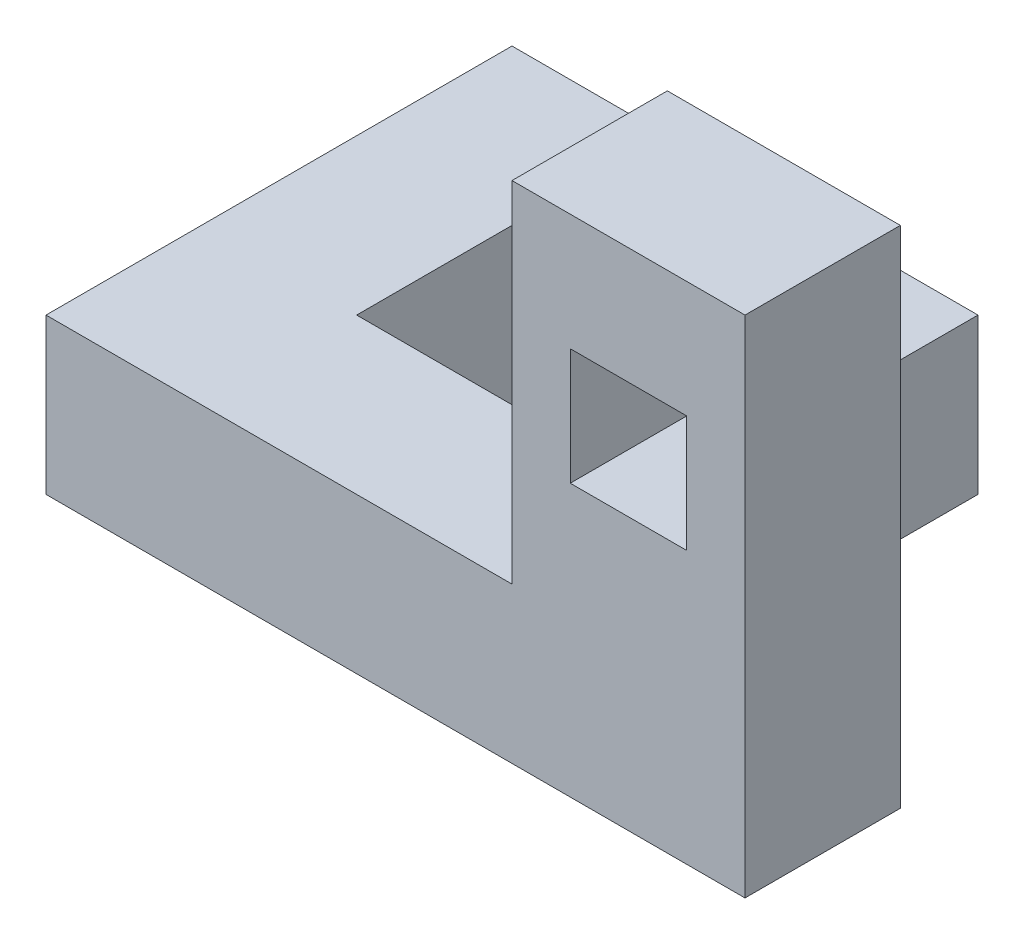
ISO-10303-21;
HEADER;
FILE_DESCRIPTION(('STEP AP214'),'2;1');
FILE_NAME('part.step','',(''),(''),'','','');
FILE_SCHEMA(('AUTOMOTIVE_DESIGN { 1 0 10303 214 1 1 1 1 }'));
ENDSEC;
DATA;
#1=APPLICATION_CONTEXT('core data for automotive mechanical design processes');
#2=APPLICATION_PROTOCOL_DEFINITION('international standard','automotive_design',2000,#1);
#3=PRODUCT_CONTEXT('',#1,'mechanical');
#4=PRODUCT('Part','Part','',(#3));
#5=PRODUCT_RELATED_PRODUCT_CATEGORY('part','',(#4));
#6=PRODUCT_DEFINITION_FORMATION('','',#4);
#7=PRODUCT_DEFINITION_CONTEXT('part definition',#1,'design');
#8=PRODUCT_DEFINITION('design','',#6,#7);
#9=PRODUCT_DEFINITION_SHAPE('','',#8);
#10=(LENGTH_UNIT() NAMED_UNIT(*) SI_UNIT(.MILLI.,.METRE.));
#11=(NAMED_UNIT(*) PLANE_ANGLE_UNIT() SI_UNIT($,.RADIAN.));
#12=(NAMED_UNIT(*) SI_UNIT($,.STERADIAN.) SOLID_ANGLE_UNIT());
#13=UNCERTAINTY_MEASURE_WITH_UNIT(LENGTH_MEASURE(1.E-05),#10,'distance_accuracy_value','');
#14=(GEOMETRIC_REPRESENTATION_CONTEXT(3) GLOBAL_UNCERTAINTY_ASSIGNED_CONTEXT((#13)) GLOBAL_UNIT_ASSIGNED_CONTEXT((#10,
#11,#12)) REPRESENTATION_CONTEXT('',''));
#15=CARTESIAN_POINT('',(0.,0.,0.));
#16=DIRECTION('',(0.,0.,1.));
#17=DIRECTION('',(1.,0.,0.));
#18=AXIS2_PLACEMENT_3D('',#15,#16,#17);
#19=CARTESIAN_POINT('',(0.,20.,0.));
#20=DIRECTION('',(0.,-1.,0.));
#21=DIRECTION('',(0.,0.,-1.));
#22=AXIS2_PLACEMENT_3D('',#19,#20,#21);
#23=PLANE('',#22);
#24=DIRECTION('',(0.,0.,-1.));
#25=VECTOR('',#24,1.);
#26=CARTESIAN_POINT('',(30.,20.,30.));
#27=LINE('',#26,#25);
#28=CARTESIAN_POINT('',(30.,20.,30.));
#29=VERTEX_POINT('',#28);
#30=CARTESIAN_POINT('',(30.,20.,9.99999999999999));
#31=VERTEX_POINT('',#30);
#32=EDGE_CURVE('E245',#29,#31,#27,.T.);
#33=ORIENTED_EDGE('',*,*,#32,.T.);
#34=CARTESIAN_POINT('',(30.,20.,-30.));
#35=VERTEX_POINT('',#34);
#36=EDGE_CURVE('E249',#31,#35,#27,.T.);
#37=ORIENTED_EDGE('',*,*,#36,.T.);
#38=DIRECTION('',(-1.,0.,0.));
#39=VECTOR('',#38,1.);
#40=CARTESIAN_POINT('',(-30.,20.,-30.));
#41=LINE('',#40,#39);
#42=CARTESIAN_POINT('',(-30.,20.,-30.));
#43=VERTEX_POINT('',#42);
#44=EDGE_CURVE('E248',#35,#43,#41,.T.);
#45=ORIENTED_EDGE('',*,*,#44,.T.);
#46=DIRECTION('',(0.,0.,1.));
#47=VECTOR('',#46,1.);
#48=CARTESIAN_POINT('',(-30.,20.,30.));
#49=LINE('',#48,#47);
#50=CARTESIAN_POINT('',(-30.,20.,30.));
#51=VERTEX_POINT('',#50);
#52=EDGE_CURVE('E251',#43,#51,#49,.T.);
#53=ORIENTED_EDGE('',*,*,#52,.T.);
#54=DIRECTION('',(1.,0.,0.));
#55=VECTOR('',#54,1.);
#56=CARTESIAN_POINT('',(-30.,20.,30.));
#57=LINE('',#56,#55);
#58=EDGE_CURVE('E253',#51,#29,#57,.T.);
#59=ORIENTED_EDGE('',*,*,#58,.T.);
#60=EDGE_LOOP('',(#33,#37,#45,#53,#59));
#61=FACE_BOUND('',#60,.T.);
#62=DIRECTION('',(0.,0.,-1.));
#63=VECTOR('',#62,1.);
#64=CARTESIAN_POINT('',(10.,20.,9.99999999999999));
#65=LINE('',#64,#63);
#66=CARTESIAN_POINT('',(10.,20.,9.99999999999999));
#67=VERTEX_POINT('',#66);
#68=CARTESIAN_POINT('',(10.,20.,-10.));
#69=VERTEX_POINT('',#68);
#70=EDGE_CURVE('E216',#67,#69,#65,.T.);
#71=ORIENTED_EDGE('',*,*,#70,.F.);
#72=DIRECTION('',(1.,0.,0.));
#73=VECTOR('',#72,1.);
#74=CARTESIAN_POINT('',(-9.99999999999999,20.,9.99999999999999));
#75=LINE('',#74,#73);
#76=CARTESIAN_POINT('',(-9.99999999999999,20.,9.99999999999999));
#77=VERTEX_POINT('',#76);
#78=EDGE_CURVE('E223',#77,#67,#75,.T.);
#79=ORIENTED_EDGE('',*,*,#78,.F.);
#80=DIRECTION('',(0.,0.,1.));
#81=VECTOR('',#80,1.);
#82=CARTESIAN_POINT('',(-9.99999999999999,20.,9.99999999999999));
#83=LINE('',#82,#81);
#84=CARTESIAN_POINT('',(-9.99999999999999,20.,-10.));
#85=VERTEX_POINT('',#84);
#86=EDGE_CURVE('E221',#85,#77,#83,.T.);
#87=ORIENTED_EDGE('',*,*,#86,.F.);
#88=DIRECTION('',(-1.,0.,0.));
#89=VECTOR('',#88,1.);
#90=CARTESIAN_POINT('',(-9.99999999999999,20.,-10.));
#91=LINE('',#90,#89);
#92=EDGE_CURVE('E218',#69,#85,#91,.T.);
#93=ORIENTED_EDGE('',*,*,#92,.F.);
#94=EDGE_LOOP('',(#71,#79,#87,#93));
#95=FACE_BOUND('',#94,.T.);
#96=ADVANCED_FACE('F37',(#61,#95),#23,.F.);
#97=CARTESIAN_POINT('',(0.,0.,0.));
#98=DIRECTION('',(0.,-1.,0.));
#99=DIRECTION('',(0.,0.,-1.));
#100=AXIS2_PLACEMENT_3D('',#97,#98,#99);
#101=PLANE('',#100);
#102=DIRECTION('',(0.,0.,-1.));
#103=VECTOR('',#102,1.);
#104=CARTESIAN_POINT('',(30.,0.,30.));
#105=LINE('',#104,#103);
#106=CARTESIAN_POINT('',(30.,0.,9.99999999999999));
#107=VERTEX_POINT('',#106);
#108=CARTESIAN_POINT('',(30.,0.,-30.));
#109=VERTEX_POINT('',#108);
#110=EDGE_CURVE('E244',#107,#109,#105,.T.);
#111=ORIENTED_EDGE('',*,*,#110,.F.);
#112=DIRECTION('',(1.,0.,0.));
#113=VECTOR('',#112,1.);
#114=CARTESIAN_POINT('',(30.,0.,9.99999999999999));
#115=LINE('',#114,#113);
#116=CARTESIAN_POINT('',(60.,0.,9.99999999999999));
#117=VERTEX_POINT('',#116);
#118=EDGE_CURVE('E54',#107,#117,#115,.T.);
#119=ORIENTED_EDGE('',*,*,#118,.T.);
#120=DIRECTION('',(0.,0.,1.));
#121=VECTOR('',#120,1.);
#122=CARTESIAN_POINT('',(60.,0.,9.99999999999999));
#123=LINE('',#122,#121);
#124=CARTESIAN_POINT('',(60.,0.,30.));
#125=VERTEX_POINT('',#124);
#126=EDGE_CURVE('E201',#117,#125,#123,.T.);
#127=ORIENTED_EDGE('',*,*,#126,.T.);
#128=DIRECTION('',(1.,0.,0.));
#129=VECTOR('',#128,1.);
#130=CARTESIAN_POINT('',(-30.,0.,30.));
#131=LINE('',#130,#129);
#132=CARTESIAN_POINT('',(-30.,0.,30.));
#133=VERTEX_POINT('',#132);
#134=EDGE_CURVE('E262',#133,#125,#131,.T.);
#135=ORIENTED_EDGE('',*,*,#134,.F.);
#136=DIRECTION('',(0.,0.,1.));
#137=VECTOR('',#136,1.);
#138=CARTESIAN_POINT('',(-30.,0.,30.));
#139=LINE('',#138,#137);
#140=CARTESIAN_POINT('',(-30.,0.,-30.));
#141=VERTEX_POINT('',#140);
#142=EDGE_CURVE('E260',#141,#133,#139,.T.);
#143=ORIENTED_EDGE('',*,*,#142,.F.);
#144=DIRECTION('',(-1.,0.,0.));
#145=VECTOR('',#144,1.);
#146=CARTESIAN_POINT('',(-30.,0.,-30.));
#147=LINE('',#146,#145);
#148=EDGE_CURVE('E258',#109,#141,#147,.T.);
#149=ORIENTED_EDGE('',*,*,#148,.F.);
#150=EDGE_LOOP('',(#111,#119,#127,#135,#143,#149));
#151=FACE_BOUND('',#150,.T.);
#152=DIRECTION('',(1.,0.,0.));
#153=VECTOR('',#152,1.);
#154=CARTESIAN_POINT('',(-9.99999999999999,0.,9.99999999999999));
#155=LINE('',#154,#153);
#156=CARTESIAN_POINT('',(-9.99999999999999,0.,9.99999999999999));
#157=VERTEX_POINT('',#156);
#158=CARTESIAN_POINT('',(10.,0.,9.99999999999999));
#159=VERTEX_POINT('',#158);
#160=EDGE_CURVE('E219',#157,#159,#155,.T.);
#161=ORIENTED_EDGE('',*,*,#160,.T.);
#162=DIRECTION('',(0.,0.,-1.));
#163=VECTOR('',#162,1.);
#164=CARTESIAN_POINT('',(10.,0.,9.99999999999999));
#165=LINE('',#164,#163);
#166=CARTESIAN_POINT('',(10.,0.,-10.));
#167=VERTEX_POINT('',#166);
#168=EDGE_CURVE('E211',#159,#167,#165,.T.);
#169=ORIENTED_EDGE('',*,*,#168,.T.);
#170=DIRECTION('',(-1.,0.,0.));
#171=VECTOR('',#170,1.);
#172=CARTESIAN_POINT('',(-9.99999999999999,0.,-10.));
#173=LINE('',#172,#171);
#174=CARTESIAN_POINT('',(-9.99999999999999,0.,-10.));
#175=VERTEX_POINT('',#174);
#176=EDGE_CURVE('E228',#167,#175,#173,.T.);
#177=ORIENTED_EDGE('',*,*,#176,.T.);
#178=DIRECTION('',(0.,0.,1.));
#179=VECTOR('',#178,1.);
#180=CARTESIAN_POINT('',(-9.99999999999999,0.,9.99999999999999));
#181=LINE('',#180,#179);
#182=EDGE_CURVE('E231',#175,#157,#181,.T.);
#183=ORIENTED_EDGE('',*,*,#182,.T.);
#184=EDGE_LOOP('',(#161,#169,#177,#183));
#185=FACE_BOUND('',#184,.T.);
#186=ADVANCED_FACE('F281',(#151,#185),#101,.T.);
#187=CARTESIAN_POINT('',(30.,20.,30.));
#188=DIRECTION('',(-1.,0.,0.));
#189=DIRECTION('',(0.,0.,1.));
#190=AXIS2_PLACEMENT_3D('',#187,#188,#189);
#191=PLANE('',#190);
#192=ORIENTED_EDGE('',*,*,#36,.F.);
#193=DIRECTION('',(0.,-1.,0.));
#194=VECTOR('',#193,1.);
#195=CARTESIAN_POINT('',(30.,0.,9.99999999999999));
#196=LINE('',#195,#194);
#197=EDGE_CURVE('E11',#31,#107,#196,.T.);
#198=ORIENTED_EDGE('',*,*,#197,.T.);
#199=ORIENTED_EDGE('',*,*,#110,.T.);
#200=DIRECTION('',(0.,-1.,0.));
#201=VECTOR('',#200,1.);
#202=CARTESIAN_POINT('',(30.,20.,-30.));
#203=LINE('',#202,#201);
#204=EDGE_CURVE('E41',#35,#109,#203,.T.);
#205=ORIENTED_EDGE('',*,*,#204,.F.);
#206=EDGE_LOOP('',(#192,#198,#199,#205));
#207=FACE_BOUND('',#206,.T.);
#208=ADVANCED_FACE('F39',(#207),#191,.F.);
#209=CARTESIAN_POINT('',(-30.,20.,-30.));
#210=DIRECTION('',(0.,0.,1.));
#211=DIRECTION('',(1.,0.,0.));
#212=AXIS2_PLACEMENT_3D('',#209,#210,#211);
#213=PLANE('',#212);
#214=ORIENTED_EDGE('',*,*,#148,.T.);
#215=DIRECTION('',(0.,-1.,0.));
#216=VECTOR('',#215,1.);
#217=CARTESIAN_POINT('',(-30.,20.,-30.));
#218=LINE('',#217,#216);
#219=EDGE_CURVE('E265',#43,#141,#218,.T.);
#220=ORIENTED_EDGE('',*,*,#219,.F.);
#221=ORIENTED_EDGE('',*,*,#44,.F.);
#222=ORIENTED_EDGE('',*,*,#204,.T.);
#223=EDGE_LOOP('',(#214,#220,#221,#222));
#224=FACE_BOUND('',#223,.T.);
#225=ADVANCED_FACE('F275',(#224),#213,.F.);
#226=CARTESIAN_POINT('',(-30.,20.,30.));
#227=DIRECTION('',(1.,0.,0.));
#228=DIRECTION('',(0.,0.,-1.));
#229=AXIS2_PLACEMENT_3D('',#226,#227,#228);
#230=PLANE('',#229);
#231=ORIENTED_EDGE('',*,*,#142,.T.);
#232=DIRECTION('',(0.,-1.,0.));
#233=VECTOR('',#232,1.);
#234=CARTESIAN_POINT('',(-30.,20.,30.));
#235=LINE('',#234,#233);
#236=EDGE_CURVE('E256',#51,#133,#235,.T.);
#237=ORIENTED_EDGE('',*,*,#236,.F.);
#238=ORIENTED_EDGE('',*,*,#52,.F.);
#239=ORIENTED_EDGE('',*,*,#219,.T.);
#240=EDGE_LOOP('',(#231,#237,#238,#239));
#241=FACE_BOUND('',#240,.T.);
#242=ADVANCED_FACE('F285',(#241),#230,.F.);
#243=CARTESIAN_POINT('',(-30.,20.,30.));
#244=DIRECTION('',(0.,0.,-1.));
#245=DIRECTION('',(-1.,0.,0.));
#246=AXIS2_PLACEMENT_3D('',#243,#244,#245);
#247=PLANE('',#246);
#248=ORIENTED_EDGE('',*,*,#134,.T.);
#249=DIRECTION('',(0.,1.,0.));
#250=VECTOR('',#249,1.);
#251=CARTESIAN_POINT('',(60.,0.,30.));
#252=LINE('',#251,#250);
#253=CARTESIAN_POINT('',(60.,65.,30.));
#254=VERTEX_POINT('',#253);
#255=EDGE_CURVE('E204',#125,#254,#252,.T.);
#256=ORIENTED_EDGE('',*,*,#255,.T.);
#257=DIRECTION('',(-1.,0.,0.));
#258=VECTOR('',#257,1.);
#259=CARTESIAN_POINT('',(30.,65.,30.));
#260=LINE('',#259,#258);
#261=CARTESIAN_POINT('',(30.,65.,30.));
#262=VERTEX_POINT('',#261);
#263=EDGE_CURVE('E193',#254,#262,#260,.T.);
#264=ORIENTED_EDGE('',*,*,#263,.T.);
#265=DIRECTION('',(0.,-1.,0.));
#266=VECTOR('',#265,1.);
#267=CARTESIAN_POINT('',(30.,0.,30.));
#268=LINE('',#267,#266);
#269=EDGE_CURVE('E188',#262,#29,#268,.T.);
#270=ORIENTED_EDGE('',*,*,#269,.T.);
#271=ORIENTED_EDGE('',*,*,#58,.F.);
#272=ORIENTED_EDGE('',*,*,#236,.T.);
#273=EDGE_LOOP('',(#248,#256,#264,#270,#271,#272));
#274=FACE_BOUND('',#273,.T.);
#275=DIRECTION('',(-1.,0.,0.));
#276=VECTOR('',#275,1.);
#277=CARTESIAN_POINT('',(37.5,50.,30.));
#278=LINE('',#277,#276);
#279=CARTESIAN_POINT('',(52.5,50.,30.));
#280=VERTEX_POINT('',#279);
#281=CARTESIAN_POINT('',(37.5,50.,30.));
#282=VERTEX_POINT('',#281);
#283=EDGE_CURVE('E182',#280,#282,#278,.T.);
#284=ORIENTED_EDGE('',*,*,#283,.F.);
#285=DIRECTION('',(0.,1.,0.));
#286=VECTOR('',#285,1.);
#287=CARTESIAN_POINT('',(52.5,35.,30.));
#288=LINE('',#287,#286);
#289=CARTESIAN_POINT('',(52.5,35.,30.));
#290=VERTEX_POINT('',#289);
#291=EDGE_CURVE('E156',#290,#280,#288,.T.);
#292=ORIENTED_EDGE('',*,*,#291,.F.);
#293=DIRECTION('',(1.,0.,0.));
#294=VECTOR('',#293,1.);
#295=CARTESIAN_POINT('',(37.5,35.,30.));
#296=LINE('',#295,#294);
#297=CARTESIAN_POINT('',(37.5,35.,30.));
#298=VERTEX_POINT('',#297);
#299=EDGE_CURVE('E173',#298,#290,#296,.T.);
#300=ORIENTED_EDGE('',*,*,#299,.F.);
#301=DIRECTION('',(0.,-1.,0.));
#302=VECTOR('',#301,1.);
#303=CARTESIAN_POINT('',(37.5,35.,30.));
#304=LINE('',#303,#302);
#305=EDGE_CURVE('E176',#282,#298,#304,.T.);
#306=ORIENTED_EDGE('',*,*,#305,.F.);
#307=EDGE_LOOP('',(#284,#292,#300,#306));
#308=FACE_BOUND('',#307,.T.);
#309=ADVANCED_FACE('F288',(#274,#308),#247,.F.);
#310=CARTESIAN_POINT('',(10.,20.,9.99999999999999));
#311=DIRECTION('',(-1.,0.,0.));
#312=DIRECTION('',(0.,0.,1.));
#313=AXIS2_PLACEMENT_3D('',#310,#311,#312);
#314=PLANE('',#313);
#315=ORIENTED_EDGE('',*,*,#168,.F.);
#316=DIRECTION('',(0.,-1.,0.));
#317=VECTOR('',#316,1.);
#318=CARTESIAN_POINT('',(10.,20.,9.99999999999999));
#319=LINE('',#318,#317);
#320=EDGE_CURVE('E225',#67,#159,#319,.T.);
#321=ORIENTED_EDGE('',*,*,#320,.F.);
#322=ORIENTED_EDGE('',*,*,#70,.T.);
#323=DIRECTION('',(0.,-1.,0.));
#324=VECTOR('',#323,1.);
#325=CARTESIAN_POINT('',(10.,20.,-10.));
#326=LINE('',#325,#324);
#327=EDGE_CURVE('E241',#69,#167,#326,.T.);
#328=ORIENTED_EDGE('',*,*,#327,.T.);
#329=EDGE_LOOP('',(#315,#321,#322,#328));
#330=FACE_BOUND('',#329,.T.);
#331=ADVANCED_FACE('F321',(#330),#314,.T.);
#332=CARTESIAN_POINT('',(-9.99999999999999,20.,-10.));
#333=DIRECTION('',(0.,0.,1.));
#334=DIRECTION('',(1.,0.,0.));
#335=AXIS2_PLACEMENT_3D('',#332,#333,#334);
#336=PLANE('',#335);
#337=ORIENTED_EDGE('',*,*,#176,.F.);
#338=ORIENTED_EDGE('',*,*,#327,.F.);
#339=ORIENTED_EDGE('',*,*,#92,.T.);
#340=DIRECTION('',(0.,-1.,0.));
#341=VECTOR('',#340,1.);
#342=CARTESIAN_POINT('',(-9.99999999999999,20.,-10.));
#343=LINE('',#342,#341);
#344=EDGE_CURVE('E239',#85,#175,#343,.T.);
#345=ORIENTED_EDGE('',*,*,#344,.T.);
#346=EDGE_LOOP('',(#337,#338,#339,#345));
#347=FACE_BOUND('',#346,.T.);
#348=ADVANCED_FACE('F411',(#347),#336,.T.);
#349=CARTESIAN_POINT('',(-9.99999999999999,20.,9.99999999999999));
#350=DIRECTION('',(1.,0.,0.));
#351=DIRECTION('',(0.,0.,-1.));
#352=AXIS2_PLACEMENT_3D('',#349,#350,#351);
#353=PLANE('',#352);
#354=ORIENTED_EDGE('',*,*,#182,.F.);
#355=ORIENTED_EDGE('',*,*,#344,.F.);
#356=ORIENTED_EDGE('',*,*,#86,.T.);
#357=DIRECTION('',(0.,-1.,0.));
#358=VECTOR('',#357,1.);
#359=CARTESIAN_POINT('',(-9.99999999999999,20.,9.99999999999999));
#360=LINE('',#359,#358);
#361=EDGE_CURVE('E61',#77,#157,#360,.T.);
#362=ORIENTED_EDGE('',*,*,#361,.T.);
#363=EDGE_LOOP('',(#354,#355,#356,#362));
#364=FACE_BOUND('',#363,.T.);
#365=ADVANCED_FACE('F407',(#364),#353,.T.);
#366=CARTESIAN_POINT('',(-9.99999999999999,20.,9.99999999999999));
#367=DIRECTION('',(0.,0.,-1.));
#368=DIRECTION('',(-1.,0.,0.));
#369=AXIS2_PLACEMENT_3D('',#366,#367,#368);
#370=PLANE('',#369);
#371=ORIENTED_EDGE('',*,*,#160,.F.);
#372=ORIENTED_EDGE('',*,*,#361,.F.);
#373=ORIENTED_EDGE('',*,*,#78,.T.);
#374=ORIENTED_EDGE('',*,*,#320,.T.);
#375=EDGE_LOOP('',(#371,#372,#373,#374));
#376=FACE_BOUND('',#375,.T.);
#377=ADVANCED_FACE('F349',(#376),#370,.T.);
#378=CARTESIAN_POINT('',(30.,0.,9.99999999999999));
#379=DIRECTION('',(-1.,0.,0.));
#380=DIRECTION('',(0.,-1.,0.));
#381=AXIS2_PLACEMENT_3D('',#378,#379,#380);
#382=PLANE('',#381);
#383=ORIENTED_EDGE('',*,*,#32,.F.);
#384=ORIENTED_EDGE('',*,*,#269,.F.);
#385=DIRECTION('',(0.,0.,1.));
#386=VECTOR('',#385,1.);
#387=CARTESIAN_POINT('',(30.,65.,9.99999999999999));
#388=LINE('',#387,#386);
#389=CARTESIAN_POINT('',(30.,65.,9.99999999999999));
#390=VERTEX_POINT('',#389);
#391=EDGE_CURVE('E209',#390,#262,#388,.T.);
#392=ORIENTED_EDGE('',*,*,#391,.F.);
#393=EDGE_CURVE('E47',#390,#31,#196,.T.);
#394=ORIENTED_EDGE('',*,*,#393,.T.);
#395=EDGE_LOOP('',(#383,#384,#392,#394));
#396=FACE_BOUND('',#395,.T.);
#397=ADVANCED_FACE('F294',(#396),#382,.T.);
#398=CARTESIAN_POINT('',(30.,65.,9.99999999999999));
#399=DIRECTION('',(0.,1.,0.));
#400=DIRECTION('',(0.,0.,1.));
#401=AXIS2_PLACEMENT_3D('',#398,#399,#400);
#402=PLANE('',#401);
#403=ORIENTED_EDGE('',*,*,#263,.F.);
#404=DIRECTION('',(0.,0.,1.));
#405=VECTOR('',#404,1.);
#406=CARTESIAN_POINT('',(60.,65.,9.99999999999999));
#407=LINE('',#406,#405);
#408=CARTESIAN_POINT('',(60.,65.,9.99999999999999));
#409=VERTEX_POINT('',#408);
#410=EDGE_CURVE('E212',#409,#254,#407,.T.);
#411=ORIENTED_EDGE('',*,*,#410,.F.);
#412=DIRECTION('',(-1.,0.,0.));
#413=VECTOR('',#412,1.);
#414=CARTESIAN_POINT('',(30.,65.,9.99999999999999));
#415=LINE('',#414,#413);
#416=EDGE_CURVE('E198',#409,#390,#415,.T.);
#417=ORIENTED_EDGE('',*,*,#416,.T.);
#418=ORIENTED_EDGE('',*,*,#391,.T.);
#419=EDGE_LOOP('',(#403,#411,#417,#418));
#420=FACE_BOUND('',#419,.T.);
#421=ADVANCED_FACE('F299',(#420),#402,.T.);
#422=CARTESIAN_POINT('',(60.,0.,9.99999999999999));
#423=DIRECTION('',(1.,0.,0.));
#424=DIRECTION('',(0.,0.,-1.));
#425=AXIS2_PLACEMENT_3D('',#422,#423,#424);
#426=PLANE('',#425);
#427=ORIENTED_EDGE('',*,*,#255,.F.);
#428=ORIENTED_EDGE('',*,*,#126,.F.);
#429=DIRECTION('',(0.,1.,0.));
#430=VECTOR('',#429,1.);
#431=CARTESIAN_POINT('',(60.,0.,9.99999999999999));
#432=LINE('',#431,#430);
#433=EDGE_CURVE('E195',#117,#409,#432,.T.);
#434=ORIENTED_EDGE('',*,*,#433,.T.);
#435=ORIENTED_EDGE('',*,*,#410,.T.);
#436=EDGE_LOOP('',(#427,#428,#434,#435));
#437=FACE_BOUND('',#436,.T.);
#438=ADVANCED_FACE('F302',(#437),#426,.T.);
#439=CARTESIAN_POINT('',(0.,0.,9.99999999999999));
#440=DIRECTION('',(0.,0.,-1.));
#441=DIRECTION('',(-1.,0.,0.));
#442=AXIS2_PLACEMENT_3D('',#439,#440,#441);
#443=PLANE('',#442);
#444=DIRECTION('',(0.,1.,0.));
#445=VECTOR('',#444,1.);
#446=CARTESIAN_POINT('',(52.5,35.,9.99999999999999));
#447=LINE('',#446,#445);
#448=CARTESIAN_POINT('',(52.5,35.,9.99999999999999));
#449=VERTEX_POINT('',#448);
#450=CARTESIAN_POINT('',(52.5,50.,9.99999999999999));
#451=VERTEX_POINT('',#450);
#452=EDGE_CURVE('E153',#449,#451,#447,.T.);
#453=ORIENTED_EDGE('',*,*,#452,.T.);
#454=DIRECTION('',(-1.,0.,0.));
#455=VECTOR('',#454,1.);
#456=CARTESIAN_POINT('',(37.5,50.,9.99999999999999));
#457=LINE('',#456,#455);
#458=CARTESIAN_POINT('',(37.5,50.,9.99999999999999));
#459=VERTEX_POINT('',#458);
#460=EDGE_CURVE('E165',#451,#459,#457,.T.);
#461=ORIENTED_EDGE('',*,*,#460,.T.);
#462=DIRECTION('',(0.,-1.,0.));
#463=VECTOR('',#462,1.);
#464=CARTESIAN_POINT('',(37.5,35.,9.99999999999999));
#465=LINE('',#464,#463);
#466=CARTESIAN_POINT('',(37.5,35.,9.99999999999999));
#467=VERTEX_POINT('',#466);
#468=EDGE_CURVE('E169',#459,#467,#465,.T.);
#469=ORIENTED_EDGE('',*,*,#468,.T.);
#470=DIRECTION('',(1.,0.,0.));
#471=VECTOR('',#470,1.);
#472=CARTESIAN_POINT('',(37.5,35.,9.99999999999999));
#473=LINE('',#472,#471);
#474=EDGE_CURVE('E161',#467,#449,#473,.T.);
#475=ORIENTED_EDGE('',*,*,#474,.T.);
#476=EDGE_LOOP('',(#453,#461,#469,#475));
#477=FACE_BOUND('',#476,.T.);
#478=ORIENTED_EDGE('',*,*,#393,.F.);
#479=ORIENTED_EDGE('',*,*,#416,.F.);
#480=ORIENTED_EDGE('',*,*,#433,.F.);
#481=ORIENTED_EDGE('',*,*,#118,.F.);
#482=ORIENTED_EDGE('',*,*,#197,.F.);
#483=EDGE_LOOP('',(#478,#479,#480,#481,#482));
#484=FACE_BOUND('',#483,.T.);
#485=ADVANCED_FACE('F171',(#477,#484),#443,.T.);
#486=CARTESIAN_POINT('',(52.5,35.,9.99999999999999));
#487=DIRECTION('',(1.,0.,0.));
#488=DIRECTION('',(0.,0.,-1.));
#489=AXIS2_PLACEMENT_3D('',#486,#487,#488);
#490=PLANE('',#489);
#491=ORIENTED_EDGE('',*,*,#291,.T.);
#492=DIRECTION('',(0.,0.,1.));
#493=VECTOR('',#492,1.);
#494=CARTESIAN_POINT('',(52.5,50.,9.99999999999999));
#495=LINE('',#494,#493);
#496=EDGE_CURVE('E149',#451,#280,#495,.T.);
#497=ORIENTED_EDGE('',*,*,#496,.F.);
#498=ORIENTED_EDGE('',*,*,#452,.F.);
#499=DIRECTION('',(0.,0.,1.));
#500=VECTOR('',#499,1.);
#501=CARTESIAN_POINT('',(52.5,35.,9.99999999999999));
#502=LINE('',#501,#500);
#503=EDGE_CURVE('E186',#449,#290,#502,.T.);
#504=ORIENTED_EDGE('',*,*,#503,.T.);
#505=EDGE_LOOP('',(#491,#497,#498,#504));
#506=FACE_BOUND('',#505,.T.);
#507=ADVANCED_FACE('F151',(#506),#490,.F.);
#508=CARTESIAN_POINT('',(37.5,35.,9.99999999999999));
#509=DIRECTION('',(0.,-1.,0.));
#510=DIRECTION('',(0.,0.,-1.));
#511=AXIS2_PLACEMENT_3D('',#508,#509,#510);
#512=PLANE('',#511);
#513=ORIENTED_EDGE('',*,*,#299,.T.);
#514=ORIENTED_EDGE('',*,*,#503,.F.);
#515=ORIENTED_EDGE('',*,*,#474,.F.);
#516=DIRECTION('',(0.,0.,1.));
#517=VECTOR('',#516,1.);
#518=CARTESIAN_POINT('',(37.5,35.,9.99999999999999));
#519=LINE('',#518,#517);
#520=EDGE_CURVE('E189',#467,#298,#519,.T.);
#521=ORIENTED_EDGE('',*,*,#520,.T.);
#522=EDGE_LOOP('',(#513,#514,#515,#521));
#523=FACE_BOUND('',#522,.T.);
#524=ADVANCED_FACE('F373',(#523),#512,.F.);
#525=CARTESIAN_POINT('',(37.5,35.,9.99999999999999));
#526=DIRECTION('',(-1.,0.,0.));
#527=DIRECTION('',(0.,0.,1.));
#528=AXIS2_PLACEMENT_3D('',#525,#526,#527);
#529=PLANE('',#528);
#530=ORIENTED_EDGE('',*,*,#305,.T.);
#531=ORIENTED_EDGE('',*,*,#520,.F.);
#532=ORIENTED_EDGE('',*,*,#468,.F.);
#533=DIRECTION('',(0.,0.,1.));
#534=VECTOR('',#533,1.);
#535=CARTESIAN_POINT('',(37.5,50.,9.99999999999999));
#536=LINE('',#535,#534);
#537=EDGE_CURVE('E160',#459,#282,#536,.T.);
#538=ORIENTED_EDGE('',*,*,#537,.T.);
#539=EDGE_LOOP('',(#530,#531,#532,#538));
#540=FACE_BOUND('',#539,.T.);
#541=ADVANCED_FACE('F382',(#540),#529,.F.);
#542=CARTESIAN_POINT('',(37.5,50.,9.99999999999999));
#543=DIRECTION('',(0.,1.,0.));
#544=DIRECTION('',(0.,0.,1.));
#545=AXIS2_PLACEMENT_3D('',#542,#543,#544);
#546=PLANE('',#545);
#547=ORIENTED_EDGE('',*,*,#283,.T.);
#548=ORIENTED_EDGE('',*,*,#537,.F.);
#549=ORIENTED_EDGE('',*,*,#460,.F.);
#550=ORIENTED_EDGE('',*,*,#496,.T.);
#551=EDGE_LOOP('',(#547,#548,#549,#550));
#552=FACE_BOUND('',#551,.T.);
#553=ADVANCED_FACE('F166',(#552),#546,.F.);
#554=CLOSED_SHELL('',(#96,#186,#208,#225,#242,#309,#331,#348,#365,#377,#397,#421,#438,#485,#507,
#524,#541,#553));
#555=MANIFOLD_SOLID_BREP('B2',#554);
#556=ADVANCED_BREP_SHAPE_REPRESENTATION('',(#18,#555),#14);
#557=SHAPE_DEFINITION_REPRESENTATION(#9,#556);
ENDSEC;
END-ISO-10303-21;
